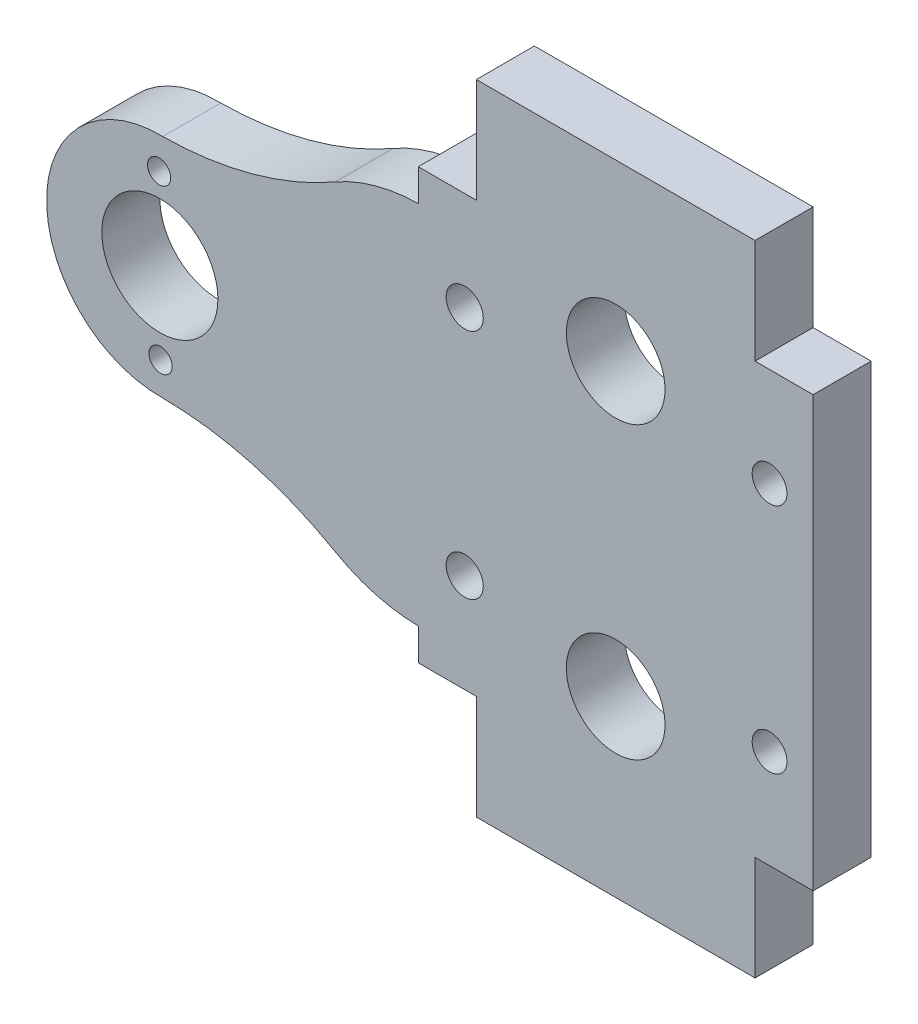
ISO-10303-21;
HEADER;
FILE_DESCRIPTION(('STEP AP214'),'2;1');
FILE_NAME('part.step','',(''),(''),'','','');
FILE_SCHEMA(('AUTOMOTIVE_DESIGN { 1 0 10303 214 1 1 1 1 }'));
ENDSEC;
DATA;
#1=APPLICATION_CONTEXT('core data for automotive mechanical design processes');
#2=APPLICATION_PROTOCOL_DEFINITION('international standard','automotive_design',2000,#1);
#3=PRODUCT_CONTEXT('',#1,'mechanical');
#4=PRODUCT('Part','Part','',(#3));
#5=PRODUCT_RELATED_PRODUCT_CATEGORY('part','',(#4));
#6=PRODUCT_DEFINITION_FORMATION('','',#4);
#7=PRODUCT_DEFINITION_CONTEXT('part definition',#1,'design');
#8=PRODUCT_DEFINITION('design','',#6,#7);
#9=PRODUCT_DEFINITION_SHAPE('','',#8);
#10=(LENGTH_UNIT() NAMED_UNIT(*) SI_UNIT(.MILLI.,.METRE.));
#11=(NAMED_UNIT(*) PLANE_ANGLE_UNIT() SI_UNIT($,.RADIAN.));
#12=(NAMED_UNIT(*) SI_UNIT($,.STERADIAN.) SOLID_ANGLE_UNIT());
#13=UNCERTAINTY_MEASURE_WITH_UNIT(LENGTH_MEASURE(1.E-05),#10,'distance_accuracy_value','');
#14=(GEOMETRIC_REPRESENTATION_CONTEXT(3) GLOBAL_UNCERTAINTY_ASSIGNED_CONTEXT((#13)) GLOBAL_UNIT_ASSIGNED_CONTEXT((#10,
#11,#12)) REPRESENTATION_CONTEXT('',''));
#15=CARTESIAN_POINT('',(0.,0.,0.));
#16=DIRECTION('',(0.,0.,1.));
#17=DIRECTION('',(1.,0.,0.));
#18=AXIS2_PLACEMENT_3D('',#15,#16,#17);
#19=CARTESIAN_POINT('',(16.700860260171,3.2922916539892,5.));
#20=DIRECTION('',(0.,0.,1.));
#21=DIRECTION('',(1.,0.,0.));
#22=AXIS2_PLACEMENT_3D('',#19,#20,#21);
#23=PLANE('',#22);
#24=CARTESIAN_POINT('',(20.5009159395274,-7.70770834601083,5.));
#25=DIRECTION('',(0.,0.,1.));
#26=DIRECTION('',(1.,0.,0.));
#27=AXIS2_PLACEMENT_3D('',#24,#25,#26);
#28=CIRCLE('',#27,1.6);
#29=CARTESIAN_POINT('',(22.1009159395274,-7.70770834601083,5.));
#30=VERTEX_POINT('',#29);
#31=EDGE_CURVE('E829',#30,#30,#28,.T.);
#32=ORIENTED_EDGE('',*,*,#31,.F.);
#33=EDGE_LOOP('',(#32));
#34=FACE_BOUND('',#33,.T.);
#35=CARTESIAN_POINT('',(20.5009159395274,12.2922916539892,5.));
#36=DIRECTION('',(0.,0.,1.));
#37=DIRECTION('',(1.,0.,0.));
#38=AXIS2_PLACEMENT_3D('',#35,#36,#37);
#39=CIRCLE('',#38,1.6);
#40=CARTESIAN_POINT('',(22.1009159395274,12.2922916539892,5.));
#41=VERTEX_POINT('',#40);
#42=EDGE_CURVE('E831',#41,#41,#39,.T.);
#43=ORIENTED_EDGE('',*,*,#42,.F.);
#44=EDGE_LOOP('',(#43));
#45=FACE_BOUND('',#44,.T.);
#46=DIRECTION('',(1.,0.,0.));
#47=VECTOR('',#46,1.);
#48=CARTESIAN_POINT('',(50.5009159395274,20.7922916539892,5.));
#49=LINE('',#48,#47);
#50=CARTESIAN_POINT('',(45.5009159395274,20.7922916539892,5.));
#51=VERTEX_POINT('',#50);
#52=CARTESIAN_POINT('',(50.5009159395274,20.7922916539892,5.));
#53=VERTEX_POINT('',#52);
#54=EDGE_CURVE('E237',#51,#53,#49,.T.);
#55=ORIENTED_EDGE('',*,*,#54,.F.);
#56=DIRECTION('',(0.,-1.,0.));
#57=VECTOR('',#56,1.);
#58=CARTESIAN_POINT('',(45.5009159395274,29.1887382633958,5.));
#59=LINE('',#58,#57);
#60=CARTESIAN_POINT('',(45.5009159395274,29.7922916539892,5.));
#61=VERTEX_POINT('',#60);
#62=EDGE_CURVE('E259',#61,#51,#59,.T.);
#63=ORIENTED_EDGE('',*,*,#62,.F.);
#64=DIRECTION('',(1.,0.,0.));
#65=VECTOR('',#64,1.);
#66=CARTESIAN_POINT('',(45.5009159395274,29.7922916539892,5.));
#67=LINE('',#66,#65);
#68=CARTESIAN_POINT('',(21.5009159395274,29.7922916539892,5.));
#69=VERTEX_POINT('',#68);
#70=EDGE_CURVE('E255',#69,#61,#67,.T.);
#71=ORIENTED_EDGE('',*,*,#70,.F.);
#72=DIRECTION('',(0.,1.,0.));
#73=VECTOR('',#72,1.);
#74=CARTESIAN_POINT('',(21.5009159395274,29.7922916539892,5.));
#75=LINE('',#74,#73);
#76=CARTESIAN_POINT('',(21.5009159395274,20.7922916539891,5.));
#77=VERTEX_POINT('',#76);
#78=EDGE_CURVE('E252',#77,#69,#75,.T.);
#79=ORIENTED_EDGE('',*,*,#78,.F.);
#80=DIRECTION('',(1.,0.,0.));
#81=VECTOR('',#80,1.);
#82=CARTESIAN_POINT('',(16.700860260171,20.7922916539891,5.));
#83=LINE('',#82,#81);
#84=CARTESIAN_POINT('',(16.5009159395274,20.7922916539892,5.));
#85=VERTEX_POINT('',#84);
#86=EDGE_CURVE('E182',#85,#77,#83,.T.);
#87=ORIENTED_EDGE('',*,*,#86,.F.);
#88=DIRECTION('',(0.,1.,0.));
#89=VECTOR('',#88,1.);
#90=CARTESIAN_POINT('',(16.5009159395274,20.7922916539892,5.));
#91=LINE('',#90,#89);
#92=CARTESIAN_POINT('',(16.5009159395274,18.0409364143949,5.));
#93=VERTEX_POINT('',#92);
#94=EDGE_CURVE('E205',#93,#85,#91,.T.);
#95=ORIENTED_EDGE('',*,*,#94,.F.);
#96=CARTESIAN_POINT('',(16.700860260171,3.2922916539892,5.));
#97=DIRECTION('',(0.,0.,1.));
#98=DIRECTION('',(1.,0.,0.));
#99=AXIS2_PLACEMENT_3D('',#96,#97,#98);
#100=CIRCLE('',#99,14.75);
#101=CARTESIAN_POINT('',(9.34226739951562,16.0756249873225,5.));
#102=VERTEX_POINT('',#101);
#103=EDGE_CURVE('E50',#93,#102,#100,.T.);
#104=ORIENTED_EDGE('',*,*,#103,.T.);
#105=CARTESIAN_POINT('',(-5.74908406047262,42.2922916539892,5.));
#106=DIRECTION('',(0.,0.,-1.));
#107=DIRECTION('',(1.,0.,0.));
#108=AXIS2_PLACEMENT_3D('',#105,#106,#107);
#109=CIRCLE('',#108,30.25);
#110=CARTESIAN_POINT('',(-5.49908406047263,12.0433247294808,5.));
#111=VERTEX_POINT('',#110);
#112=EDGE_CURVE('E335',#102,#111,#109,.T.);
#113=ORIENTED_EDGE('',*,*,#112,.T.);
#114=DIRECTION('',(3.06941559721248E-12,-1.,0.));
#115=VECTOR('',#114,1.);
#116=CARTESIAN_POINT('',(-5.49908406047263,12.0433247294808,5.));
#117=LINE('',#116,#115);
#118=CARTESIAN_POINT('',(-5.49908406047262,12.0390859987982,5.));
#119=VERTEX_POINT('',#118);
#120=EDGE_CURVE('E337',#111,#119,#117,.T.);
#121=ORIENTED_EDGE('',*,*,#120,.T.);
#122=CARTESIAN_POINT('',(-5.74908406047262,2.29229165398919,5.));
#123=DIRECTION('',(0.,0.,1.));
#124=DIRECTION('',(1.,0.,0.));
#125=AXIS2_PLACEMENT_3D('',#122,#123,#124);
#126=CIRCLE('',#125,9.75);
#127=CARTESIAN_POINT('',(-5.49908406047262,-7.45450269081977,5.));
#128=VERTEX_POINT('',#127);
#129=EDGE_CURVE('E339',#119,#128,#126,.T.);
#130=ORIENTED_EDGE('',*,*,#129,.T.);
#131=DIRECTION('',(4.09255412961497E-13,-1.,0.));
#132=VECTOR('',#131,1.);
#133=CARTESIAN_POINT('',(-5.49908406047262,-7.45450269081977,5.));
#134=LINE('',#133,#132);
#135=CARTESIAN_POINT('',(-5.49908406047262,-7.45874142150246,5.));
#136=VERTEX_POINT('',#135);
#137=EDGE_CURVE('E341',#128,#136,#134,.T.);
#138=ORIENTED_EDGE('',*,*,#137,.T.);
#139=CARTESIAN_POINT('',(-5.74908406047262,-37.7077083460108,5.));
#140=DIRECTION('',(0.,0.,-1.));
#141=DIRECTION('',(1.,0.,0.));
#142=AXIS2_PLACEMENT_3D('',#139,#140,#141);
#143=CIRCLE('',#142,30.25);
#144=CARTESIAN_POINT('',(9.3422673995156,-11.4910416793441,5.));
#145=VERTEX_POINT('',#144);
#146=EDGE_CURVE('E343',#136,#145,#143,.T.);
#147=ORIENTED_EDGE('',*,*,#146,.T.);
#148=CARTESIAN_POINT('',(16.700860260171,1.2922916539892,5.));
#149=DIRECTION('',(0.,0.,1.));
#150=DIRECTION('',(1.,0.,0.));
#151=AXIS2_PLACEMENT_3D('',#148,#149,#150);
#152=CIRCLE('',#151,14.75);
#153=CARTESIAN_POINT('',(16.5009159395274,-13.4563531064165,5.));
#154=VERTEX_POINT('',#153);
#155=EDGE_CURVE('E196',#145,#154,#152,.T.);
#156=ORIENTED_EDGE('',*,*,#155,.T.);
#157=DIRECTION('',(0.,1.,0.));
#158=VECTOR('',#157,1.);
#159=CARTESIAN_POINT('',(16.5009159395274,-13.4563531064165,5.));
#160=LINE('',#159,#158);
#161=CARTESIAN_POINT('',(16.5009159395274,-16.2077083460108,5.));
#162=VERTEX_POINT('',#161);
#163=EDGE_CURVE('E187',#162,#154,#160,.T.);
#164=ORIENTED_EDGE('',*,*,#163,.F.);
#165=DIRECTION('',(-1.,0.,0.));
#166=VECTOR('',#165,1.);
#167=CARTESIAN_POINT('',(16.700860260171,-16.2077083460108,5.));
#168=LINE('',#167,#166);
#169=CARTESIAN_POINT('',(21.5009159395274,-16.2077083460108,5.));
#170=VERTEX_POINT('',#169);
#171=EDGE_CURVE('E171',#170,#162,#168,.T.);
#172=ORIENTED_EDGE('',*,*,#171,.F.);
#173=DIRECTION('',(0.,1.,0.));
#174=VECTOR('',#173,1.);
#175=CARTESIAN_POINT('',(21.5009159395274,-25.2077083460108,5.));
#176=LINE('',#175,#174);
#177=CARTESIAN_POINT('',(21.5009159395274,-25.2077083460108,5.));
#178=VERTEX_POINT('',#177);
#179=EDGE_CURVE('E282',#178,#170,#176,.T.);
#180=ORIENTED_EDGE('',*,*,#179,.F.);
#181=DIRECTION('',(1.,0.,0.));
#182=VECTOR('',#181,1.);
#183=CARTESIAN_POINT('',(26.2509159395273,-25.2077083460108,5.));
#184=LINE('',#183,#182);
#185=CARTESIAN_POINT('',(45.5009159395274,-25.2077083460108,5.));
#186=VERTEX_POINT('',#185);
#187=EDGE_CURVE('E331',#178,#186,#184,.T.);
#188=ORIENTED_EDGE('',*,*,#187,.T.);
#189=DIRECTION('',(0.,-1.,0.));
#190=VECTOR('',#189,1.);
#191=CARTESIAN_POINT('',(45.5009159395274,-25.2077083460108,5.));
#192=LINE('',#191,#190);
#193=CARTESIAN_POINT('',(45.5009159395274,-16.2077083460108,5.));
#194=VERTEX_POINT('',#193);
#195=EDGE_CURVE('E273',#194,#186,#192,.T.);
#196=ORIENTED_EDGE('',*,*,#195,.F.);
#197=DIRECTION('',(-1.,0.,0.));
#198=VECTOR('',#197,1.);
#199=CARTESIAN_POINT('',(50.0009159395274,-16.2077083460108,5.));
#200=LINE('',#199,#198);
#201=CARTESIAN_POINT('',(50.5009159395274,-16.2077083460108,5.));
#202=VERTEX_POINT('',#201);
#203=EDGE_CURVE('E233',#202,#194,#200,.T.);
#204=ORIENTED_EDGE('',*,*,#203,.F.);
#205=DIRECTION('',(0.,-1.,0.));
#206=VECTOR('',#205,1.);
#207=CARTESIAN_POINT('',(50.5009159395274,-16.2077083460108,5.));
#208=LINE('',#207,#206);
#209=EDGE_CURVE('E230',#53,#202,#208,.T.);
#210=ORIENTED_EDGE('',*,*,#209,.F.);
#211=EDGE_LOOP('',(#55,#63,#71,#79,#87,#95,#104,#113,#121,#130,#138,#147,#156,#164,#172,#180,
#188,#196,#204,#210));
#212=FACE_BOUND('',#211,.T.);
#213=CARTESIAN_POINT('',(33.5009159395274,-10.2077083460108,5.));
#214=DIRECTION('',(0.,0.,1.));
#215=DIRECTION('',(1.,0.,0.));
#216=AXIS2_PLACEMENT_3D('',#213,#214,#215);
#217=CIRCLE('',#216,4.25000000000001);
#218=CARTESIAN_POINT('',(37.7509159395274,-10.2077083460108,5.));
#219=VERTEX_POINT('',#218);
#220=EDGE_CURVE('E307',#219,#219,#217,.T.);
#221=ORIENTED_EDGE('',*,*,#220,.F.);
#222=EDGE_LOOP('',(#221));
#223=FACE_BOUND('',#222,.T.);
#224=CARTESIAN_POINT('',(46.7509159395274,12.2922916539892,5.));
#225=DIRECTION('',(0.,0.,1.));
#226=DIRECTION('',(1.,0.,0.));
#227=AXIS2_PLACEMENT_3D('',#224,#225,#226);
#228=CIRCLE('',#227,1.5);
#229=CARTESIAN_POINT('',(48.2509159395274,12.2922916539892,5.));
#230=VERTEX_POINT('',#229);
#231=EDGE_CURVE('E319',#230,#230,#228,.T.);
#232=ORIENTED_EDGE('',*,*,#231,.F.);
#233=EDGE_LOOP('',(#232));
#234=FACE_BOUND('',#233,.T.);
#235=CARTESIAN_POINT('',(46.7509159395274,-7.70770834601081,5.));
#236=DIRECTION('',(0.,0.,1.));
#237=DIRECTION('',(1.,0.,0.));
#238=AXIS2_PLACEMENT_3D('',#235,#236,#237);
#239=CIRCLE('',#238,1.5);
#240=CARTESIAN_POINT('',(48.2509159395274,-7.70770834601081,5.));
#241=VERTEX_POINT('',#240);
#242=EDGE_CURVE('E325',#241,#241,#239,.T.);
#243=ORIENTED_EDGE('',*,*,#242,.F.);
#244=EDGE_LOOP('',(#243));
#245=FACE_BOUND('',#244,.T.);
#246=CARTESIAN_POINT('',(33.5009159395274,14.7922916539892,5.));
#247=DIRECTION('',(0.,0.,1.));
#248=DIRECTION('',(1.,0.,0.));
#249=AXIS2_PLACEMENT_3D('',#246,#247,#248);
#250=CIRCLE('',#249,4.25);
#251=CARTESIAN_POINT('',(37.7509159395274,14.7922916539892,5.));
#252=VERTEX_POINT('',#251);
#253=EDGE_CURVE('E313',#252,#252,#250,.T.);
#254=ORIENTED_EDGE('',*,*,#253,.F.);
#255=EDGE_LOOP('',(#254));
#256=FACE_BOUND('',#255,.T.);
#257=CARTESIAN_POINT('',(-5.74908406047262,2.29229165398919,5.));
#258=DIRECTION('',(0.,0.,1.));
#259=DIRECTION('',(1.,0.,0.));
#260=AXIS2_PLACEMENT_3D('',#257,#258,#259);
#261=CIRCLE('',#260,5.);
#262=CARTESIAN_POINT('',(-0.749084060472621,2.29229165398919,5.));
#263=VERTEX_POINT('',#262);
#264=EDGE_CURVE('E301',#263,#263,#261,.T.);
#265=ORIENTED_EDGE('',*,*,#264,.F.);
#266=EDGE_LOOP('',(#265));
#267=FACE_BOUND('',#266,.T.);
#268=CARTESIAN_POINT('',(-5.68662948504604,-4.70770834601081,5.));
#269=DIRECTION('',(0.,0.,1.));
#270=DIRECTION('',(1.,0.,0.));
#271=AXIS2_PLACEMENT_3D('',#268,#269,#270);
#272=CIRCLE('',#271,1.);
#273=CARTESIAN_POINT('',(-4.68662948504604,-4.70770834601081,5.));
#274=VERTEX_POINT('',#273);
#275=EDGE_CURVE('E295',#274,#274,#272,.T.);
#276=ORIENTED_EDGE('',*,*,#275,.F.);
#277=EDGE_LOOP('',(#276));
#278=FACE_BOUND('',#277,.T.);
#279=CARTESIAN_POINT('',(-5.8115386358992,9.29229165398919,5.));
#280=DIRECTION('',(0.,0.,1.));
#281=DIRECTION('',(1.,0.,0.));
#282=AXIS2_PLACEMENT_3D('',#279,#280,#281);
#283=CIRCLE('',#282,1.);
#284=CARTESIAN_POINT('',(-4.8115386358992,9.29229165398919,5.));
#285=VERTEX_POINT('',#284);
#286=EDGE_CURVE('E289',#285,#285,#283,.T.);
#287=ORIENTED_EDGE('',*,*,#286,.F.);
#288=EDGE_LOOP('',(#287));
#289=FACE_BOUND('',#288,.T.);
#290=ADVANCED_FACE('F35',(#34,#45,#212,#223,#234,#245,#256,#267,#278,#289),#23,.T.);
#291=CARTESIAN_POINT('',(16.700860260171,3.2922916539892,0.));
#292=DIRECTION('',(0.,0.,1.));
#293=DIRECTION('',(1.,0.,0.));
#294=AXIS2_PLACEMENT_3D('',#291,#292,#293);
#295=PLANE('',#294);
#296=DIRECTION('',(0.,-1.,0.));
#297=VECTOR('',#296,1.);
#298=CARTESIAN_POINT('',(45.5009159395274,29.1887382633958,0.));
#299=LINE('',#298,#297);
#300=CARTESIAN_POINT('',(45.5009159395274,29.7922916539892,0.));
#301=VERTEX_POINT('',#300);
#302=CARTESIAN_POINT('',(45.5009159395274,20.7922916539892,0.));
#303=VERTEX_POINT('',#302);
#304=EDGE_CURVE('E256',#301,#303,#299,.T.);
#305=ORIENTED_EDGE('',*,*,#304,.T.);
#306=DIRECTION('',(1.,0.,0.));
#307=VECTOR('',#306,1.);
#308=CARTESIAN_POINT('',(50.5009159395274,20.7922916539892,0.));
#309=LINE('',#308,#307);
#310=CARTESIAN_POINT('',(50.5009159395274,20.7922916539892,0.));
#311=VERTEX_POINT('',#310);
#312=EDGE_CURVE('E234',#303,#311,#309,.T.);
#313=ORIENTED_EDGE('',*,*,#312,.T.);
#314=DIRECTION('',(0.,-1.,0.));
#315=VECTOR('',#314,1.);
#316=CARTESIAN_POINT('',(50.5009159395274,-16.2077083460108,0.));
#317=LINE('',#316,#315);
#318=CARTESIAN_POINT('',(50.5009159395274,-16.2077083460108,0.));
#319=VERTEX_POINT('',#318);
#320=EDGE_CURVE('E229',#311,#319,#317,.T.);
#321=ORIENTED_EDGE('',*,*,#320,.T.);
#322=DIRECTION('',(-1.,0.,0.));
#323=VECTOR('',#322,1.);
#324=CARTESIAN_POINT('',(50.0009159395274,-16.2077083460108,0.));
#325=LINE('',#324,#323);
#326=CARTESIAN_POINT('',(45.5009159395274,-16.2077083460108,0.));
#327=VERTEX_POINT('',#326);
#328=EDGE_CURVE('E243',#319,#327,#325,.T.);
#329=ORIENTED_EDGE('',*,*,#328,.T.);
#330=DIRECTION('',(0.,-1.,0.));
#331=VECTOR('',#330,1.);
#332=CARTESIAN_POINT('',(45.5009159395274,-25.2077083460108,0.));
#333=LINE('',#332,#331);
#334=CARTESIAN_POINT('',(45.5009159395274,-25.2077083460108,0.));
#335=VERTEX_POINT('',#334);
#336=EDGE_CURVE('E271',#327,#335,#333,.T.);
#337=ORIENTED_EDGE('',*,*,#336,.T.);
#338=DIRECTION('',(1.,0.,0.));
#339=VECTOR('',#338,1.);
#340=CARTESIAN_POINT('',(26.2509159395273,-25.2077083460108,0.));
#341=LINE('',#340,#339);
#342=CARTESIAN_POINT('',(21.5009159395274,-25.2077083460108,0.));
#343=VERTEX_POINT('',#342);
#344=EDGE_CURVE('E328',#343,#335,#341,.T.);
#345=ORIENTED_EDGE('',*,*,#344,.F.);
#346=DIRECTION('',(0.,1.,0.));
#347=VECTOR('',#346,1.);
#348=CARTESIAN_POINT('',(21.5009159395274,-25.2077083460108,0.));
#349=LINE('',#348,#347);
#350=CARTESIAN_POINT('',(21.5009159395274,-16.2077083460108,0.));
#351=VERTEX_POINT('',#350);
#352=EDGE_CURVE('E281',#343,#351,#349,.T.);
#353=ORIENTED_EDGE('',*,*,#352,.T.);
#354=DIRECTION('',(1.,0.,0.));
#355=VECTOR('',#354,1.);
#356=CARTESIAN_POINT('',(21.2509159395274,-16.2077083460108,0.));
#357=LINE('',#356,#355);
#358=CARTESIAN_POINT('',(16.5009159395274,-16.2077083460108,0.));
#359=VERTEX_POINT('',#358);
#360=EDGE_CURVE('E219',#359,#351,#357,.T.);
#361=ORIENTED_EDGE('',*,*,#360,.F.);
#362=DIRECTION('',(0.,1.,0.));
#363=VECTOR('',#362,1.);
#364=CARTESIAN_POINT('',(16.5009159395274,-13.4563531064165,0.));
#365=LINE('',#364,#363);
#366=CARTESIAN_POINT('',(16.5009159395274,-13.4563531064165,0.));
#367=VERTEX_POINT('',#366);
#368=EDGE_CURVE('E190',#359,#367,#365,.T.);
#369=ORIENTED_EDGE('',*,*,#368,.T.);
#370=CARTESIAN_POINT('',(16.700860260171,1.2922916539892,0.));
#371=DIRECTION('',(0.,0.,1.));
#372=DIRECTION('',(1.,0.,0.));
#373=AXIS2_PLACEMENT_3D('',#370,#371,#372);
#374=CIRCLE('',#373,14.75);
#375=CARTESIAN_POINT('',(9.3422673995156,-11.4910416793441,0.));
#376=VERTEX_POINT('',#375);
#377=EDGE_CURVE('E333',#376,#367,#374,.T.);
#378=ORIENTED_EDGE('',*,*,#377,.F.);
#379=CARTESIAN_POINT('',(-5.74908406047262,-37.7077083460108,0.));
#380=DIRECTION('',(0.,0.,-1.));
#381=DIRECTION('',(1.,0.,0.));
#382=AXIS2_PLACEMENT_3D('',#379,#380,#381);
#383=CIRCLE('',#382,30.25);
#384=CARTESIAN_POINT('',(-5.49908406047262,-7.45874142150246,0.));
#385=VERTEX_POINT('',#384);
#386=EDGE_CURVE('E358',#385,#376,#383,.T.);
#387=ORIENTED_EDGE('',*,*,#386,.F.);
#388=DIRECTION('',(4.09255412961497E-13,-1.,0.));
#389=VECTOR('',#388,1.);
#390=CARTESIAN_POINT('',(-5.49908406047262,-7.45450269081977,0.));
#391=LINE('',#390,#389);
#392=CARTESIAN_POINT('',(-5.49908406047262,-7.45450269081977,0.));
#393=VERTEX_POINT('',#392);
#394=EDGE_CURVE('E356',#393,#385,#391,.T.);
#395=ORIENTED_EDGE('',*,*,#394,.F.);
#396=CARTESIAN_POINT('',(-5.74908406047262,2.29229165398919,0.));
#397=DIRECTION('',(0.,0.,1.));
#398=DIRECTION('',(1.,0.,0.));
#399=AXIS2_PLACEMENT_3D('',#396,#397,#398);
#400=CIRCLE('',#399,9.75);
#401=CARTESIAN_POINT('',(-5.49908406047262,12.0390859987982,0.));
#402=VERTEX_POINT('',#401);
#403=EDGE_CURVE('E354',#402,#393,#400,.T.);
#404=ORIENTED_EDGE('',*,*,#403,.F.);
#405=DIRECTION('',(3.06941559721248E-12,-1.,0.));
#406=VECTOR('',#405,1.);
#407=CARTESIAN_POINT('',(-5.49908406047263,12.0433247294808,0.));
#408=LINE('',#407,#406);
#409=CARTESIAN_POINT('',(-5.49908406047263,12.0433247294808,0.));
#410=VERTEX_POINT('',#409);
#411=EDGE_CURVE('E352',#410,#402,#408,.T.);
#412=ORIENTED_EDGE('',*,*,#411,.F.);
#413=CARTESIAN_POINT('',(-5.74908406047262,42.2922916539892,0.));
#414=DIRECTION('',(0.,0.,-1.));
#415=DIRECTION('',(1.,0.,0.));
#416=AXIS2_PLACEMENT_3D('',#413,#414,#415);
#417=CIRCLE('',#416,30.25);
#418=CARTESIAN_POINT('',(9.34226739951562,16.0756249873225,0.));
#419=VERTEX_POINT('',#418);
#420=EDGE_CURVE('E350',#419,#410,#417,.T.);
#421=ORIENTED_EDGE('',*,*,#420,.F.);
#422=CARTESIAN_POINT('',(16.700860260171,3.2922916539892,0.));
#423=DIRECTION('',(0.,0.,1.));
#424=DIRECTION('',(1.,0.,0.));
#425=AXIS2_PLACEMENT_3D('',#422,#423,#424);
#426=CIRCLE('',#425,14.75);
#427=CARTESIAN_POINT('',(16.5009159395274,18.0409364143949,0.));
#428=VERTEX_POINT('',#427);
#429=EDGE_CURVE('E348',#428,#419,#426,.T.);
#430=ORIENTED_EDGE('',*,*,#429,.F.);
#431=DIRECTION('',(0.,1.,0.));
#432=VECTOR('',#431,1.);
#433=CARTESIAN_POINT('',(16.5009159395274,20.7922916539892,0.));
#434=LINE('',#433,#432);
#435=CARTESIAN_POINT('',(16.5009159395274,20.7922916539892,0.));
#436=VERTEX_POINT('',#435);
#437=EDGE_CURVE('E203',#428,#436,#434,.T.);
#438=ORIENTED_EDGE('',*,*,#437,.T.);
#439=DIRECTION('',(-1.,0.,0.));
#440=VECTOR('',#439,1.);
#441=CARTESIAN_POINT('',(21.5009159395274,20.7922916539891,0.));
#442=LINE('',#441,#440);
#443=CARTESIAN_POINT('',(21.5009159395274,20.7922916539891,0.));
#444=VERTEX_POINT('',#443);
#445=EDGE_CURVE('E213',#444,#436,#442,.T.);
#446=ORIENTED_EDGE('',*,*,#445,.F.);
#447=DIRECTION('',(0.,1.,0.));
#448=VECTOR('',#447,1.);
#449=CARTESIAN_POINT('',(21.5009159395274,29.7922916539892,0.));
#450=LINE('',#449,#448);
#451=CARTESIAN_POINT('',(21.5009159395274,29.7922916539892,0.));
#452=VERTEX_POINT('',#451);
#453=EDGE_CURVE('E250',#444,#452,#450,.T.);
#454=ORIENTED_EDGE('',*,*,#453,.T.);
#455=DIRECTION('',(1.,0.,0.));
#456=VECTOR('',#455,1.);
#457=CARTESIAN_POINT('',(45.5009159395274,29.7922916539892,0.));
#458=LINE('',#457,#456);
#459=EDGE_CURVE('E265',#452,#301,#458,.T.);
#460=ORIENTED_EDGE('',*,*,#459,.T.);
#461=EDGE_LOOP('',(#305,#313,#321,#329,#337,#345,#353,#361,#369,#378,#387,#395,#404,#412,#421,
#430,#438,#446,#454,#460));
#462=FACE_BOUND('',#461,.T.);
#463=CARTESIAN_POINT('',(46.7509159395274,-7.70770834601081,0.));
#464=DIRECTION('',(0.,0.,1.));
#465=DIRECTION('',(1.,0.,0.));
#466=AXIS2_PLACEMENT_3D('',#463,#464,#465);
#467=CIRCLE('',#466,1.5);
#468=CARTESIAN_POINT('',(48.2509159395274,-7.70770834601081,0.));
#469=VERTEX_POINT('',#468);
#470=EDGE_CURVE('E322',#469,#469,#467,.T.);
#471=ORIENTED_EDGE('',*,*,#470,.T.);
#472=EDGE_LOOP('',(#471));
#473=FACE_BOUND('',#472,.T.);
#474=CARTESIAN_POINT('',(46.7509159395274,12.2922916539892,0.));
#475=DIRECTION('',(0.,0.,1.));
#476=DIRECTION('',(1.,0.,0.));
#477=AXIS2_PLACEMENT_3D('',#474,#475,#476);
#478=CIRCLE('',#477,1.5);
#479=CARTESIAN_POINT('',(48.2509159395274,12.2922916539892,0.));
#480=VERTEX_POINT('',#479);
#481=EDGE_CURVE('E316',#480,#480,#478,.T.);
#482=ORIENTED_EDGE('',*,*,#481,.T.);
#483=EDGE_LOOP('',(#482));
#484=FACE_BOUND('',#483,.T.);
#485=CARTESIAN_POINT('',(33.5009159395274,14.7922916539892,0.));
#486=DIRECTION('',(0.,0.,1.));
#487=DIRECTION('',(1.,0.,0.));
#488=AXIS2_PLACEMENT_3D('',#485,#486,#487);
#489=CIRCLE('',#488,4.25);
#490=CARTESIAN_POINT('',(37.7509159395274,14.7922916539892,0.));
#491=VERTEX_POINT('',#490);
#492=EDGE_CURVE('E310',#491,#491,#489,.T.);
#493=ORIENTED_EDGE('',*,*,#492,.T.);
#494=EDGE_LOOP('',(#493));
#495=FACE_BOUND('',#494,.T.);
#496=CARTESIAN_POINT('',(33.5009159395274,-10.2077083460108,0.));
#497=DIRECTION('',(0.,0.,1.));
#498=DIRECTION('',(1.,0.,0.));
#499=AXIS2_PLACEMENT_3D('',#496,#497,#498);
#500=CIRCLE('',#499,4.25000000000001);
#501=CARTESIAN_POINT('',(37.7509159395274,-10.2077083460108,0.));
#502=VERTEX_POINT('',#501);
#503=EDGE_CURVE('E304',#502,#502,#500,.T.);
#504=ORIENTED_EDGE('',*,*,#503,.T.);
#505=EDGE_LOOP('',(#504));
#506=FACE_BOUND('',#505,.T.);
#507=CARTESIAN_POINT('',(20.5009159395274,12.2922916539892,0.));
#508=DIRECTION('',(0.,0.,1.));
#509=DIRECTION('',(1.,0.,0.));
#510=AXIS2_PLACEMENT_3D('',#507,#508,#509);
#511=CIRCLE('',#510,1.6);
#512=CARTESIAN_POINT('',(22.1009159395274,12.2922916539892,0.));
#513=VERTEX_POINT('',#512);
#514=EDGE_CURVE('E198',#513,#513,#511,.T.);
#515=ORIENTED_EDGE('',*,*,#514,.T.);
#516=EDGE_LOOP('',(#515));
#517=FACE_BOUND('',#516,.T.);
#518=CARTESIAN_POINT('',(20.5009159395274,-7.70770834601083,0.));
#519=DIRECTION('',(0.,0.,1.));
#520=DIRECTION('',(1.,0.,0.));
#521=AXIS2_PLACEMENT_3D('',#518,#519,#520);
#522=CIRCLE('',#521,1.6);
#523=CARTESIAN_POINT('',(22.1009159395274,-7.70770834601083,0.));
#524=VERTEX_POINT('',#523);
#525=EDGE_CURVE('E819',#524,#524,#522,.T.);
#526=ORIENTED_EDGE('',*,*,#525,.T.);
#527=EDGE_LOOP('',(#526));
#528=FACE_BOUND('',#527,.T.);
#529=CARTESIAN_POINT('',(-5.74908406047262,2.29229165398919,0.));
#530=DIRECTION('',(0.,0.,1.));
#531=DIRECTION('',(1.,0.,0.));
#532=AXIS2_PLACEMENT_3D('',#529,#530,#531);
#533=CIRCLE('',#532,5.);
#534=CARTESIAN_POINT('',(-0.749084060472621,2.29229165398919,0.));
#535=VERTEX_POINT('',#534);
#536=EDGE_CURVE('E298',#535,#535,#533,.T.);
#537=ORIENTED_EDGE('',*,*,#536,.T.);
#538=EDGE_LOOP('',(#537));
#539=FACE_BOUND('',#538,.T.);
#540=CARTESIAN_POINT('',(-5.68662948504604,-4.70770834601081,0.));
#541=DIRECTION('',(0.,0.,1.));
#542=DIRECTION('',(1.,0.,0.));
#543=AXIS2_PLACEMENT_3D('',#540,#541,#542);
#544=CIRCLE('',#543,1.);
#545=CARTESIAN_POINT('',(-4.68662948504604,-4.70770834601081,0.));
#546=VERTEX_POINT('',#545);
#547=EDGE_CURVE('E292',#546,#546,#544,.T.);
#548=ORIENTED_EDGE('',*,*,#547,.T.);
#549=EDGE_LOOP('',(#548));
#550=FACE_BOUND('',#549,.T.);
#551=CARTESIAN_POINT('',(-5.8115386358992,9.29229165398919,0.));
#552=DIRECTION('',(0.,0.,1.));
#553=DIRECTION('',(1.,0.,0.));
#554=AXIS2_PLACEMENT_3D('',#551,#552,#553);
#555=CIRCLE('',#554,1.);
#556=CARTESIAN_POINT('',(-4.8115386358992,9.29229165398919,0.));
#557=VERTEX_POINT('',#556);
#558=EDGE_CURVE('E288',#557,#557,#555,.T.);
#559=ORIENTED_EDGE('',*,*,#558,.T.);
#560=EDGE_LOOP('',(#559));
#561=FACE_BOUND('',#560,.T.);
#562=ADVANCED_FACE('F384',(#462,#473,#484,#495,#506,#517,#528,#539,#550,#561),#295,.F.);
#563=CARTESIAN_POINT('',(26.2509159395273,-25.2077083460108,5.));
#564=DIRECTION('',(0.,1.,0.));
#565=DIRECTION('',(0.,0.,1.));
#566=AXIS2_PLACEMENT_3D('',#563,#564,#565);
#567=PLANE('',#566);
#568=ORIENTED_EDGE('',*,*,#344,.T.);
#569=DIRECTION('',(0.,0.,-1.));
#570=VECTOR('',#569,1.);
#571=CARTESIAN_POINT('',(45.5009159395274,-25.2077083460108,5.));
#572=LINE('',#571,#570);
#573=EDGE_CURVE('E276',#186,#335,#572,.T.);
#574=ORIENTED_EDGE('',*,*,#573,.F.);
#575=ORIENTED_EDGE('',*,*,#187,.F.);
#576=DIRECTION('',(0.,0.,-1.));
#577=VECTOR('',#576,1.);
#578=CARTESIAN_POINT('',(21.5009159395274,-25.2077083460108,5.));
#579=LINE('',#578,#577);
#580=EDGE_CURVE('E284',#178,#343,#579,.T.);
#581=ORIENTED_EDGE('',*,*,#580,.T.);
#582=EDGE_LOOP('',(#568,#574,#575,#581));
#583=FACE_BOUND('',#582,.T.);
#584=ADVANCED_FACE('F37',(#583),#567,.F.);
#585=CARTESIAN_POINT('',(16.700860260171,3.2922916539892,5.));
#586=DIRECTION('',(0.,0.,-1.));
#587=DIRECTION('',(-1.,0.,0.));
#588=AXIS2_PLACEMENT_3D('',#585,#586,#587);
#589=CYLINDRICAL_SURFACE('',#588,14.75);
#590=ORIENTED_EDGE('',*,*,#103,.F.);
#591=DIRECTION('',(0.,0.,-1.));
#592=VECTOR('',#591,1.);
#593=CARTESIAN_POINT('',(16.5009159395274,18.0409364143949,5.));
#594=LINE('',#593,#592);
#595=EDGE_CURVE('E54',#93,#428,#594,.T.);
#596=ORIENTED_EDGE('',*,*,#595,.T.);
#597=ORIENTED_EDGE('',*,*,#429,.T.);
#598=DIRECTION('',(0.,0.,-1.));
#599=VECTOR('',#598,1.);
#600=CARTESIAN_POINT('',(9.34226739951562,16.0756249873225,5.));
#601=LINE('',#600,#599);
#602=EDGE_CURVE('E11',#102,#419,#601,.T.);
#603=ORIENTED_EDGE('',*,*,#602,.F.);
#604=EDGE_LOOP('',(#590,#596,#597,#603));
#605=FACE_BOUND('',#604,.T.);
#606=ADVANCED_FACE('F400',(#605),#589,.T.);
#607=CARTESIAN_POINT('',(-5.74908406047262,42.2922916539892,5.));
#608=DIRECTION('',(0.,0.,-1.));
#609=DIRECTION('',(-1.,0.,0.));
#610=AXIS2_PLACEMENT_3D('',#607,#608,#609);
#611=CYLINDRICAL_SURFACE('',#610,30.25);
#612=ORIENTED_EDGE('',*,*,#420,.T.);
#613=DIRECTION('',(0.,0.,-1.));
#614=VECTOR('',#613,1.);
#615=CARTESIAN_POINT('',(-5.49908406047263,12.0433247294808,5.));
#616=LINE('',#615,#614);
#617=EDGE_CURVE('E43',#111,#410,#616,.T.);
#618=ORIENTED_EDGE('',*,*,#617,.F.);
#619=ORIENTED_EDGE('',*,*,#112,.F.);
#620=ORIENTED_EDGE('',*,*,#602,.T.);
#621=EDGE_LOOP('',(#612,#618,#619,#620));
#622=FACE_BOUND('',#621,.T.);
#623=ADVANCED_FACE('F399',(#622),#611,.F.);
#624=CARTESIAN_POINT('',(-5.49908406047263,12.0433247294808,5.));
#625=DIRECTION('',(1.,3.06941559721249E-12,0.));
#626=DIRECTION('',(-3.06941559721249E-12,1.,0.));
#627=AXIS2_PLACEMENT_3D('',#624,#625,#626);
#628=PLANE('',#627);
#629=ORIENTED_EDGE('',*,*,#411,.T.);
#630=DIRECTION('',(0.,0.,-1.));
#631=VECTOR('',#630,1.);
#632=CARTESIAN_POINT('',(-5.49908406047262,12.0390859987982,5.));
#633=LINE('',#632,#631);
#634=EDGE_CURVE('E370',#119,#402,#633,.T.);
#635=ORIENTED_EDGE('',*,*,#634,.F.);
#636=ORIENTED_EDGE('',*,*,#120,.F.);
#637=ORIENTED_EDGE('',*,*,#617,.T.);
#638=EDGE_LOOP('',(#629,#635,#636,#637));
#639=FACE_BOUND('',#638,.T.);
#640=ADVANCED_FACE('F377',(#639),#628,.F.);
#641=CARTESIAN_POINT('',(-5.74908406047262,2.29229165398919,5.));
#642=DIRECTION('',(0.,0.,-1.));
#643=DIRECTION('',(-1.,0.,0.));
#644=AXIS2_PLACEMENT_3D('',#641,#642,#643);
#645=CYLINDRICAL_SURFACE('',#644,9.75);
#646=ORIENTED_EDGE('',*,*,#403,.T.);
#647=DIRECTION('',(0.,0.,-1.));
#648=VECTOR('',#647,1.);
#649=CARTESIAN_POINT('',(-5.49908406047262,-7.45450269081977,5.));
#650=LINE('',#649,#648);
#651=EDGE_CURVE('E367',#128,#393,#650,.T.);
#652=ORIENTED_EDGE('',*,*,#651,.F.);
#653=ORIENTED_EDGE('',*,*,#129,.F.);
#654=ORIENTED_EDGE('',*,*,#634,.T.);
#655=EDGE_LOOP('',(#646,#652,#653,#654));
#656=FACE_BOUND('',#655,.T.);
#657=ADVANCED_FACE('F390',(#656),#645,.T.);
#658=CARTESIAN_POINT('',(-5.49908406047262,-7.45450269081977,5.));
#659=DIRECTION('',(1.,4.09255412961497E-13,0.));
#660=DIRECTION('',(-4.09255412961497E-13,1.,0.));
#661=AXIS2_PLACEMENT_3D('',#658,#659,#660);
#662=PLANE('',#661);
#663=ORIENTED_EDGE('',*,*,#394,.T.);
#664=DIRECTION('',(0.,0.,-1.));
#665=VECTOR('',#664,1.);
#666=CARTESIAN_POINT('',(-5.49908406047262,-7.45874142150246,5.));
#667=LINE('',#666,#665);
#668=EDGE_CURVE('E364',#136,#385,#667,.T.);
#669=ORIENTED_EDGE('',*,*,#668,.F.);
#670=ORIENTED_EDGE('',*,*,#137,.F.);
#671=ORIENTED_EDGE('',*,*,#651,.T.);
#672=EDGE_LOOP('',(#663,#669,#670,#671));
#673=FACE_BOUND('',#672,.T.);
#674=ADVANCED_FACE('F394',(#673),#662,.F.);
#675=CARTESIAN_POINT('',(-5.74908406047262,-37.7077083460108,5.));
#676=DIRECTION('',(0.,0.,-1.));
#677=DIRECTION('',(-1.,0.,0.));
#678=AXIS2_PLACEMENT_3D('',#675,#676,#677);
#679=CYLINDRICAL_SURFACE('',#678,30.25);
#680=ORIENTED_EDGE('',*,*,#386,.T.);
#681=DIRECTION('',(0.,0.,-1.));
#682=VECTOR('',#681,1.);
#683=CARTESIAN_POINT('',(9.3422673995156,-11.4910416793441,5.));
#684=LINE('',#683,#682);
#685=EDGE_CURVE('E346',#145,#376,#684,.T.);
#686=ORIENTED_EDGE('',*,*,#685,.F.);
#687=ORIENTED_EDGE('',*,*,#146,.F.);
#688=ORIENTED_EDGE('',*,*,#668,.T.);
#689=EDGE_LOOP('',(#680,#686,#687,#688));
#690=FACE_BOUND('',#689,.T.);
#691=ADVANCED_FACE('F467',(#690),#679,.F.);
#692=CARTESIAN_POINT('',(16.700860260171,1.2922916539892,5.));
#693=DIRECTION('',(0.,0.,-1.));
#694=DIRECTION('',(-1.,0.,0.));
#695=AXIS2_PLACEMENT_3D('',#692,#693,#694);
#696=CYLINDRICAL_SURFACE('',#695,14.75);
#697=ORIENTED_EDGE('',*,*,#377,.T.);
#698=DIRECTION('',(0.,0.,-1.));
#699=VECTOR('',#698,1.);
#700=CARTESIAN_POINT('',(16.5009159395274,-13.4563531064165,5.));
#701=LINE('',#700,#699);
#702=EDGE_CURVE('E191',#154,#367,#701,.T.);
#703=ORIENTED_EDGE('',*,*,#702,.F.);
#704=ORIENTED_EDGE('',*,*,#155,.F.);
#705=ORIENTED_EDGE('',*,*,#685,.T.);
#706=EDGE_LOOP('',(#697,#703,#704,#705));
#707=FACE_BOUND('',#706,.T.);
#708=ADVANCED_FACE('F464',(#707),#696,.T.);
#709=CARTESIAN_POINT('',(46.7509159395274,-7.70770834601081,5.));
#710=DIRECTION('',(0.,0.,-1.));
#711=DIRECTION('',(-1.,0.,0.));
#712=AXIS2_PLACEMENT_3D('',#709,#710,#711);
#713=CYLINDRICAL_SURFACE('',#712,1.5);
#714=ORIENTED_EDGE('',*,*,#242,.T.);
#715=EDGE_LOOP('',(#714));
#716=FACE_BOUND('',#715,.T.);
#717=ORIENTED_EDGE('',*,*,#470,.F.);
#718=EDGE_LOOP('',(#717));
#719=FACE_BOUND('',#718,.T.);
#720=ADVANCED_FACE('F461',(#716,#719),#713,.F.);
#721=CARTESIAN_POINT('',(46.7509159395274,12.2922916539892,5.));
#722=DIRECTION('',(0.,0.,-1.));
#723=DIRECTION('',(-1.,0.,0.));
#724=AXIS2_PLACEMENT_3D('',#721,#722,#723);
#725=CYLINDRICAL_SURFACE('',#724,1.5);
#726=ORIENTED_EDGE('',*,*,#231,.T.);
#727=EDGE_LOOP('',(#726));
#728=FACE_BOUND('',#727,.T.);
#729=ORIENTED_EDGE('',*,*,#481,.F.);
#730=EDGE_LOOP('',(#729));
#731=FACE_BOUND('',#730,.T.);
#732=ADVANCED_FACE('F753',(#728,#731),#725,.F.);
#733=CARTESIAN_POINT('',(33.5009159395274,14.7922916539892,5.));
#734=DIRECTION('',(0.,0.,-1.));
#735=DIRECTION('',(-1.,0.,0.));
#736=AXIS2_PLACEMENT_3D('',#733,#734,#735);
#737=CYLINDRICAL_SURFACE('',#736,4.25);
#738=ORIENTED_EDGE('',*,*,#253,.T.);
#739=EDGE_LOOP('',(#738));
#740=FACE_BOUND('',#739,.T.);
#741=ORIENTED_EDGE('',*,*,#492,.F.);
#742=EDGE_LOOP('',(#741));
#743=FACE_BOUND('',#742,.T.);
#744=ADVANCED_FACE('F744',(#740,#743),#737,.F.);
#745=CARTESIAN_POINT('',(33.5009159395274,-10.2077083460108,5.));
#746=DIRECTION('',(0.,0.,-1.));
#747=DIRECTION('',(-1.,0.,0.));
#748=AXIS2_PLACEMENT_3D('',#745,#746,#747);
#749=CYLINDRICAL_SURFACE('',#748,4.25000000000001);
#750=ORIENTED_EDGE('',*,*,#220,.T.);
#751=EDGE_LOOP('',(#750));
#752=FACE_BOUND('',#751,.T.);
#753=ORIENTED_EDGE('',*,*,#503,.F.);
#754=EDGE_LOOP('',(#753));
#755=FACE_BOUND('',#754,.T.);
#756=ADVANCED_FACE('F735',(#752,#755),#749,.F.);
#757=CARTESIAN_POINT('',(-5.74908406047262,2.29229165398919,5.));
#758=DIRECTION('',(0.,0.,-1.));
#759=DIRECTION('',(-1.,0.,0.));
#760=AXIS2_PLACEMENT_3D('',#757,#758,#759);
#761=CYLINDRICAL_SURFACE('',#760,5.);
#762=ORIENTED_EDGE('',*,*,#264,.T.);
#763=EDGE_LOOP('',(#762));
#764=FACE_BOUND('',#763,.T.);
#765=ORIENTED_EDGE('',*,*,#536,.F.);
#766=EDGE_LOOP('',(#765));
#767=FACE_BOUND('',#766,.T.);
#768=ADVANCED_FACE('F726',(#764,#767),#761,.F.);
#769=CARTESIAN_POINT('',(-5.68662948504604,-4.70770834601081,5.));
#770=DIRECTION('',(0.,0.,-1.));
#771=DIRECTION('',(-1.,0.,0.));
#772=AXIS2_PLACEMENT_3D('',#769,#770,#771);
#773=CYLINDRICAL_SURFACE('',#772,1.);
#774=ORIENTED_EDGE('',*,*,#275,.T.);
#775=EDGE_LOOP('',(#774));
#776=FACE_BOUND('',#775,.T.);
#777=ORIENTED_EDGE('',*,*,#547,.F.);
#778=EDGE_LOOP('',(#777));
#779=FACE_BOUND('',#778,.T.);
#780=ADVANCED_FACE('F448',(#776,#779),#773,.F.);
#781=CARTESIAN_POINT('',(-5.8115386358992,9.29229165398919,5.));
#782=DIRECTION('',(0.,0.,-1.));
#783=DIRECTION('',(-1.,0.,0.));
#784=AXIS2_PLACEMENT_3D('',#781,#782,#783);
#785=CYLINDRICAL_SURFACE('',#784,1.);
#786=ORIENTED_EDGE('',*,*,#286,.T.);
#787=EDGE_LOOP('',(#786));
#788=FACE_BOUND('',#787,.T.);
#789=ORIENTED_EDGE('',*,*,#558,.F.);
#790=EDGE_LOOP('',(#789));
#791=FACE_BOUND('',#790,.T.);
#792=ADVANCED_FACE('F441',(#788,#791),#785,.F.);
#793=CARTESIAN_POINT('',(21.5009159395274,-25.2077083460108,5.));
#794=DIRECTION('',(-1.,0.,0.));
#795=DIRECTION('',(0.,-1.,0.));
#796=AXIS2_PLACEMENT_3D('',#793,#794,#795);
#797=PLANE('',#796);
#798=ORIENTED_EDGE('',*,*,#352,.F.);
#799=ORIENTED_EDGE('',*,*,#580,.F.);
#800=ORIENTED_EDGE('',*,*,#179,.T.);
#801=DIRECTION('',(0.,0.,-1.));
#802=VECTOR('',#801,1.);
#803=CARTESIAN_POINT('',(21.5009159395274,-16.2077083460108,10.));
#804=LINE('',#803,#802);
#805=EDGE_CURVE('E178',#170,#351,#804,.T.);
#806=ORIENTED_EDGE('',*,*,#805,.T.);
#807=EDGE_LOOP('',(#798,#799,#800,#806));
#808=FACE_BOUND('',#807,.T.);
#809=ADVANCED_FACE('F439',(#808),#797,.T.);
#810=CARTESIAN_POINT('',(45.5009159395274,-25.2077083460108,5.));
#811=DIRECTION('',(1.,0.,0.));
#812=DIRECTION('',(0.,0.,-1.));
#813=AXIS2_PLACEMENT_3D('',#810,#811,#812);
#814=PLANE('',#813);
#815=ORIENTED_EDGE('',*,*,#336,.F.);
#816=DIRECTION('',(0.,0.,-1.));
#817=VECTOR('',#816,1.);
#818=CARTESIAN_POINT('',(45.5009159395274,-16.2077083460108,10.));
#819=LINE('',#818,#817);
#820=EDGE_CURVE('E183',#194,#327,#819,.T.);
#821=ORIENTED_EDGE('',*,*,#820,.F.);
#822=ORIENTED_EDGE('',*,*,#195,.T.);
#823=ORIENTED_EDGE('',*,*,#573,.T.);
#824=EDGE_LOOP('',(#815,#821,#822,#823));
#825=FACE_BOUND('',#824,.T.);
#826=ADVANCED_FACE('F433',(#825),#814,.T.);
#827=CARTESIAN_POINT('',(45.5009159395274,29.1887382633958,5.));
#828=DIRECTION('',(1.,0.,0.));
#829=DIRECTION('',(0.,0.,-1.));
#830=AXIS2_PLACEMENT_3D('',#827,#828,#829);
#831=PLANE('',#830);
#832=ORIENTED_EDGE('',*,*,#304,.F.);
#833=DIRECTION('',(0.,0.,-1.));
#834=VECTOR('',#833,1.);
#835=CARTESIAN_POINT('',(45.5009159395274,29.7922916539892,5.));
#836=LINE('',#835,#834);
#837=EDGE_CURVE('E269',#61,#301,#836,.T.);
#838=ORIENTED_EDGE('',*,*,#837,.F.);
#839=ORIENTED_EDGE('',*,*,#62,.T.);
#840=DIRECTION('',(0.,0.,-1.));
#841=VECTOR('',#840,1.);
#842=CARTESIAN_POINT('',(45.5009159395274,20.7922916539892,10.));
#843=LINE('',#842,#841);
#844=EDGE_CURVE('E220',#51,#303,#843,.T.);
#845=ORIENTED_EDGE('',*,*,#844,.T.);
#846=EDGE_LOOP('',(#832,#838,#839,#845));
#847=FACE_BOUND('',#846,.T.);
#848=ADVANCED_FACE('F418',(#847),#831,.T.);
#849=CARTESIAN_POINT('',(45.5009159395274,29.7922916539892,5.));
#850=DIRECTION('',(0.,1.,0.));
#851=DIRECTION('',(-1.,0.,0.));
#852=AXIS2_PLACEMENT_3D('',#849,#850,#851);
#853=PLANE('',#852);
#854=ORIENTED_EDGE('',*,*,#459,.F.);
#855=DIRECTION('',(0.,0.,-1.));
#856=VECTOR('',#855,1.);
#857=CARTESIAN_POINT('',(21.5009159395274,29.7922916539892,5.));
#858=LINE('',#857,#856);
#859=EDGE_CURVE('E262',#69,#452,#858,.T.);
#860=ORIENTED_EDGE('',*,*,#859,.F.);
#861=ORIENTED_EDGE('',*,*,#70,.T.);
#862=ORIENTED_EDGE('',*,*,#837,.T.);
#863=EDGE_LOOP('',(#854,#860,#861,#862));
#864=FACE_BOUND('',#863,.T.);
#865=ADVANCED_FACE('F415',(#864),#853,.T.);
#866=CARTESIAN_POINT('',(21.5009159395274,29.7922916539892,5.));
#867=DIRECTION('',(-1.,0.,0.));
#868=DIRECTION('',(0.,0.,1.));
#869=AXIS2_PLACEMENT_3D('',#866,#867,#868);
#870=PLANE('',#869);
#871=ORIENTED_EDGE('',*,*,#453,.F.);
#872=DIRECTION('',(0.,0.,-1.));
#873=VECTOR('',#872,1.);
#874=CARTESIAN_POINT('',(21.5009159395274,20.7922916539891,10.));
#875=LINE('',#874,#873);
#876=EDGE_CURVE('E216',#77,#444,#875,.T.);
#877=ORIENTED_EDGE('',*,*,#876,.F.);
#878=ORIENTED_EDGE('',*,*,#78,.T.);
#879=ORIENTED_EDGE('',*,*,#859,.T.);
#880=EDGE_LOOP('',(#871,#877,#878,#879));
#881=FACE_BOUND('',#880,.T.);
#882=ADVANCED_FACE('F412',(#881),#870,.T.);
#883=CARTESIAN_POINT('',(50.5009159395274,-16.2077083460108,5.));
#884=DIRECTION('',(1.,0.,0.));
#885=DIRECTION('',(0.,1.,0.));
#886=AXIS2_PLACEMENT_3D('',#883,#884,#885);
#887=PLANE('',#886);
#888=ORIENTED_EDGE('',*,*,#320,.F.);
#889=DIRECTION('',(0.,0.,-1.));
#890=VECTOR('',#889,1.);
#891=CARTESIAN_POINT('',(50.5009159395274,20.7922916539892,5.));
#892=LINE('',#891,#890);
#893=EDGE_CURVE('E248',#53,#311,#892,.T.);
#894=ORIENTED_EDGE('',*,*,#893,.F.);
#895=ORIENTED_EDGE('',*,*,#209,.T.);
#896=DIRECTION('',(0.,0.,-1.));
#897=VECTOR('',#896,1.);
#898=CARTESIAN_POINT('',(50.5009159395274,-16.2077083460108,5.));
#899=LINE('',#898,#897);
#900=EDGE_CURVE('E240',#202,#319,#899,.T.);
#901=ORIENTED_EDGE('',*,*,#900,.T.);
#902=EDGE_LOOP('',(#888,#894,#895,#901));
#903=FACE_BOUND('',#902,.T.);
#904=ADVANCED_FACE('F426',(#903),#887,.T.);
#905=CARTESIAN_POINT('',(50.5009159395274,20.7922916539892,5.));
#906=DIRECTION('',(0.,1.,0.));
#907=DIRECTION('',(0.,0.,1.));
#908=AXIS2_PLACEMENT_3D('',#905,#906,#907);
#909=PLANE('',#908);
#910=ORIENTED_EDGE('',*,*,#312,.F.);
#911=ORIENTED_EDGE('',*,*,#844,.F.);
#912=ORIENTED_EDGE('',*,*,#54,.T.);
#913=ORIENTED_EDGE('',*,*,#893,.T.);
#914=EDGE_LOOP('',(#910,#911,#912,#913));
#915=FACE_BOUND('',#914,.T.);
#916=ADVANCED_FACE('F422',(#915),#909,.T.);
#917=CARTESIAN_POINT('',(50.0009159395274,-16.2077083460108,5.));
#918=DIRECTION('',(0.,-1.,0.));
#919=DIRECTION('',(1.,0.,0.));
#920=AXIS2_PLACEMENT_3D('',#917,#918,#919);
#921=PLANE('',#920);
#922=ORIENTED_EDGE('',*,*,#328,.F.);
#923=ORIENTED_EDGE('',*,*,#900,.F.);
#924=ORIENTED_EDGE('',*,*,#203,.T.);
#925=ORIENTED_EDGE('',*,*,#820,.T.);
#926=EDGE_LOOP('',(#922,#923,#924,#925));
#927=FACE_BOUND('',#926,.T.);
#928=ADVANCED_FACE('F430',(#927),#921,.T.);
#929=CARTESIAN_POINT('',(21.5009159395274,20.7922916539891,10.));
#930=DIRECTION('',(0.,-1.,0.));
#931=DIRECTION('',(0.,0.,-1.));
#932=AXIS2_PLACEMENT_3D('',#929,#930,#931);
#933=PLANE('',#932);
#934=ORIENTED_EDGE('',*,*,#86,.T.);
#935=ORIENTED_EDGE('',*,*,#876,.T.);
#936=ORIENTED_EDGE('',*,*,#445,.T.);
#937=DIRECTION('',(0.,0.,-1.));
#938=VECTOR('',#937,1.);
#939=CARTESIAN_POINT('',(16.5009159395274,20.7922916539892,5.));
#940=LINE('',#939,#938);
#941=EDGE_CURVE('E210',#85,#436,#940,.T.);
#942=ORIENTED_EDGE('',*,*,#941,.F.);
#943=EDGE_LOOP('',(#934,#935,#936,#942));
#944=FACE_BOUND('',#943,.T.);
#945=ADVANCED_FACE('F407',(#944),#933,.F.);
#946=CARTESIAN_POINT('',(21.2509159395274,-16.2077083460108,10.));
#947=DIRECTION('',(0.,1.,0.));
#948=DIRECTION('',(0.,0.,1.));
#949=AXIS2_PLACEMENT_3D('',#946,#947,#948);
#950=PLANE('',#949);
#951=ORIENTED_EDGE('',*,*,#171,.T.);
#952=DIRECTION('',(0.,0.,-1.));
#953=VECTOR('',#952,1.);
#954=CARTESIAN_POINT('',(16.5009159395274,-16.2077083460108,5.));
#955=LINE('',#954,#953);
#956=EDGE_CURVE('E175',#162,#359,#955,.T.);
#957=ORIENTED_EDGE('',*,*,#956,.T.);
#958=ORIENTED_EDGE('',*,*,#360,.T.);
#959=ORIENTED_EDGE('',*,*,#805,.F.);
#960=EDGE_LOOP('',(#951,#957,#958,#959));
#961=FACE_BOUND('',#960,.T.);
#962=ADVANCED_FACE('F173',(#961),#950,.F.);
#963=CARTESIAN_POINT('',(16.5009159395274,20.7922916539892,5.));
#964=DIRECTION('',(-1.,0.,0.));
#965=DIRECTION('',(0.,-1.,0.));
#966=AXIS2_PLACEMENT_3D('',#963,#964,#965);
#967=PLANE('',#966);
#968=ORIENTED_EDGE('',*,*,#437,.F.);
#969=ORIENTED_EDGE('',*,*,#595,.F.);
#970=ORIENTED_EDGE('',*,*,#94,.T.);
#971=ORIENTED_EDGE('',*,*,#941,.T.);
#972=EDGE_LOOP('',(#968,#969,#970,#971));
#973=FACE_BOUND('',#972,.T.);
#974=ADVANCED_FACE('F404',(#973),#967,.T.);
#975=CARTESIAN_POINT('',(16.5009159395274,-13.4563531064165,5.));
#976=DIRECTION('',(-1.,0.,0.));
#977=DIRECTION('',(0.,-1.,0.));
#978=AXIS2_PLACEMENT_3D('',#975,#976,#977);
#979=PLANE('',#978);
#980=ORIENTED_EDGE('',*,*,#368,.F.);
#981=ORIENTED_EDGE('',*,*,#956,.F.);
#982=ORIENTED_EDGE('',*,*,#163,.T.);
#983=ORIENTED_EDGE('',*,*,#702,.T.);
#984=EDGE_LOOP('',(#980,#981,#982,#983));
#985=FACE_BOUND('',#984,.T.);
#986=ADVANCED_FACE('F186',(#985),#979,.T.);
#987=CARTESIAN_POINT('',(20.5009159395274,-7.70770834601083,-5.));
#988=DIRECTION('',(0.,0.,1.));
#989=DIRECTION('',(1.,0.,0.));
#990=AXIS2_PLACEMENT_3D('',#987,#988,#989);
#991=CYLINDRICAL_SURFACE('',#990,1.6);
#992=ORIENTED_EDGE('',*,*,#31,.T.);
#993=EDGE_LOOP('',(#992));
#994=FACE_BOUND('',#993,.T.);
#995=ORIENTED_EDGE('',*,*,#525,.F.);
#996=EDGE_LOOP('',(#995));
#997=FACE_BOUND('',#996,.T.);
#998=ADVANCED_FACE('F507',(#994,#997),#991,.F.);
#999=CARTESIAN_POINT('',(20.5009159395274,12.2922916539892,-5.));
#1000=DIRECTION('',(0.,0.,1.));
#1001=DIRECTION('',(1.,0.,0.));
#1002=AXIS2_PLACEMENT_3D('',#999,#1000,#1001);
#1003=CYLINDRICAL_SURFACE('',#1002,1.6);
#1004=ORIENTED_EDGE('',*,*,#42,.T.);
#1005=EDGE_LOOP('',(#1004));
#1006=FACE_BOUND('',#1005,.T.);
#1007=ORIENTED_EDGE('',*,*,#514,.F.);
#1008=EDGE_LOOP('',(#1007));
#1009=FACE_BOUND('',#1008,.T.);
#1010=ADVANCED_FACE('F502',(#1006,#1009),#1003,.F.);
#1011=CLOSED_SHELL('',(#290,#562,#584,#606,#623,#640,#657,#674,#691,#708,#720,#732,#744,#756,
#768,#780,#792,#809,#826,#848,#865,#882,#904,#916,#928,#945,#962,#974,#986,#998,#1010));
#1012=MANIFOLD_SOLID_BREP('B2',#1011);
#1013=ADVANCED_BREP_SHAPE_REPRESENTATION('',(#18,#1012),#14);
#1014=SHAPE_DEFINITION_REPRESENTATION(#9,#1013);
ENDSEC;
END-ISO-10303-21;
